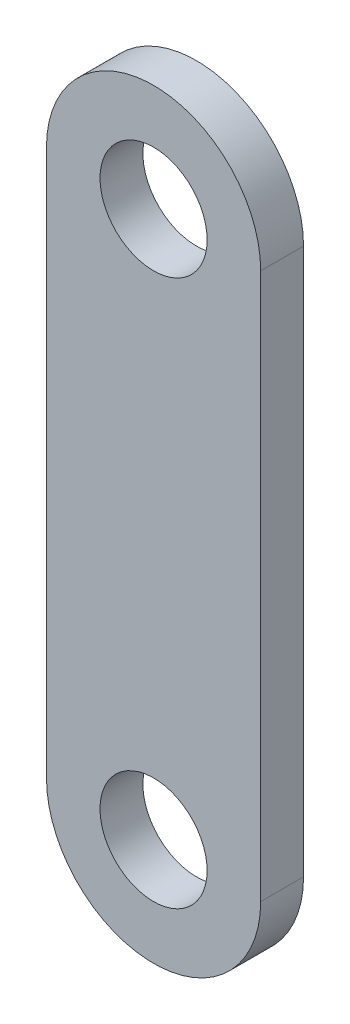
ISO-10303-21;
HEADER;
FILE_DESCRIPTION(('STEP AP214'),'2;1');
FILE_NAME('part.step','',(''),(''),'','','');
FILE_SCHEMA(('AUTOMOTIVE_DESIGN { 1 0 10303 214 1 1 1 1 }'));
ENDSEC;
DATA;
#1=APPLICATION_CONTEXT('core data for automotive mechanical design processes');
#2=APPLICATION_PROTOCOL_DEFINITION('international standard','automotive_design',2000,#1);
#3=PRODUCT_CONTEXT('',#1,'mechanical');
#4=PRODUCT('Part','Part','',(#3));
#5=PRODUCT_RELATED_PRODUCT_CATEGORY('part','',(#4));
#6=PRODUCT_DEFINITION_FORMATION('','',#4);
#7=PRODUCT_DEFINITION_CONTEXT('part definition',#1,'design');
#8=PRODUCT_DEFINITION('design','',#6,#7);
#9=PRODUCT_DEFINITION_SHAPE('','',#8);
#10=(LENGTH_UNIT() NAMED_UNIT(*) SI_UNIT(.MILLI.,.METRE.));
#11=(NAMED_UNIT(*) PLANE_ANGLE_UNIT() SI_UNIT($,.RADIAN.));
#12=(NAMED_UNIT(*) SI_UNIT($,.STERADIAN.) SOLID_ANGLE_UNIT());
#13=UNCERTAINTY_MEASURE_WITH_UNIT(LENGTH_MEASURE(1.E-05),#10,'distance_accuracy_value','');
#14=(GEOMETRIC_REPRESENTATION_CONTEXT(3) GLOBAL_UNCERTAINTY_ASSIGNED_CONTEXT((#13)) GLOBAL_UNIT_ASSIGNED_CONTEXT((#10,
#11,#12)) REPRESENTATION_CONTEXT('',''));
#15=CARTESIAN_POINT('',(0.,0.,0.));
#16=DIRECTION('',(0.,0.,1.));
#17=DIRECTION('',(1.,0.,0.));
#18=AXIS2_PLACEMENT_3D('',#15,#16,#17);
#19=CARTESIAN_POINT('',(0.,127.5,10.));
#20=DIRECTION('',(0.,0.,1.));
#21=DIRECTION('',(1.,0.,0.));
#22=AXIS2_PLACEMENT_3D('',#19,#20,#21);
#23=PLANE('',#22);
#24=CARTESIAN_POINT('',(0.,127.5,10.));
#25=DIRECTION('',(0.,0.,1.));
#26=DIRECTION('',(1.,0.,0.));
#27=AXIS2_PLACEMENT_3D('',#24,#25,#26);
#28=CIRCLE('',#27,25.);
#29=CARTESIAN_POINT('',(24.9999999999999,127.5,10.));
#30=VERTEX_POINT('',#29);
#31=EDGE_CURVE('E100',#30,#30,#28,.T.);
#32=ORIENTED_EDGE('',*,*,#31,.F.);
#33=EDGE_LOOP('',(#32));
#34=FACE_BOUND('',#33,.T.);
#35=CARTESIAN_POINT('',(0.,127.5,10.));
#36=DIRECTION('',(0.,0.,1.));
#37=DIRECTION('',(1.,0.,0.));
#38=AXIS2_PLACEMENT_3D('',#35,#36,#37);
#39=CIRCLE('',#38,50.);
#40=CARTESIAN_POINT('',(50.,127.5,10.));
#41=VERTEX_POINT('',#40);
#42=CARTESIAN_POINT('',(-50.0000000000001,127.5,10.));
#43=VERTEX_POINT('',#42);
#44=EDGE_CURVE('E85',#41,#43,#39,.T.);
#45=ORIENTED_EDGE('',*,*,#44,.T.);
#46=DIRECTION('',(0.,-1.,0.));
#47=VECTOR('',#46,1.);
#48=CARTESIAN_POINT('',(-50.0000000000001,127.5,10.));
#49=LINE('',#48,#47);
#50=CARTESIAN_POINT('',(-50.0000000000001,-127.5,10.));
#51=VERTEX_POINT('',#50);
#52=EDGE_CURVE('E80',#43,#51,#49,.T.);
#53=ORIENTED_EDGE('',*,*,#52,.T.);
#54=CARTESIAN_POINT('',(0.,-127.5,10.));
#55=DIRECTION('',(0.,0.,1.));
#56=DIRECTION('',(1.,0.,0.));
#57=AXIS2_PLACEMENT_3D('',#54,#55,#56);
#58=CIRCLE('',#57,50.);
#59=CARTESIAN_POINT('',(50.,-127.5,10.));
#60=VERTEX_POINT('',#59);
#61=EDGE_CURVE('E83',#51,#60,#58,.T.);
#62=ORIENTED_EDGE('',*,*,#61,.T.);
#63=DIRECTION('',(0.,1.,0.));
#64=VECTOR('',#63,1.);
#65=CARTESIAN_POINT('',(50.,127.5,10.));
#66=LINE('',#65,#64);
#67=EDGE_CURVE('E50',#60,#41,#66,.T.);
#68=ORIENTED_EDGE('',*,*,#67,.T.);
#69=EDGE_LOOP('',(#45,#53,#62,#68));
#70=FACE_BOUND('',#69,.T.);
#71=CARTESIAN_POINT('',(0.,-127.5,10.));
#72=DIRECTION('',(0.,0.,1.));
#73=DIRECTION('',(1.,0.,0.));
#74=AXIS2_PLACEMENT_3D('',#71,#72,#73);
#75=CIRCLE('',#74,25.);
#76=CARTESIAN_POINT('',(25.,-127.5,10.));
#77=VERTEX_POINT('',#76);
#78=EDGE_CURVE('E115',#77,#77,#75,.T.);
#79=ORIENTED_EDGE('',*,*,#78,.F.);
#80=EDGE_LOOP('',(#79));
#81=FACE_BOUND('',#80,.T.);
#82=ADVANCED_FACE('F33',(#34,#70,#81),#23,.T.);
#83=CARTESIAN_POINT('',(0.,127.5,-10.));
#84=DIRECTION('',(0.,0.,1.));
#85=DIRECTION('',(1.,0.,0.));
#86=AXIS2_PLACEMENT_3D('',#83,#84,#85);
#87=PLANE('',#86);
#88=CARTESIAN_POINT('',(0.,127.5,-10.));
#89=DIRECTION('',(0.,0.,1.));
#90=DIRECTION('',(1.,0.,0.));
#91=AXIS2_PLACEMENT_3D('',#88,#89,#90);
#92=CIRCLE('',#91,50.);
#93=CARTESIAN_POINT('',(50.,127.5,-10.));
#94=VERTEX_POINT('',#93);
#95=CARTESIAN_POINT('',(-50.0000000000001,127.5,-10.));
#96=VERTEX_POINT('',#95);
#97=EDGE_CURVE('E97',#94,#96,#92,.T.);
#98=ORIENTED_EDGE('',*,*,#97,.F.);
#99=DIRECTION('',(0.,1.,0.));
#100=VECTOR('',#99,1.);
#101=CARTESIAN_POINT('',(50.,127.5,-10.));
#102=LINE('',#101,#100);
#103=CARTESIAN_POINT('',(50.,-127.5,-10.));
#104=VERTEX_POINT('',#103);
#105=EDGE_CURVE('E73',#104,#94,#102,.T.);
#106=ORIENTED_EDGE('',*,*,#105,.F.);
#107=CARTESIAN_POINT('',(0.,-127.5,-10.));
#108=DIRECTION('',(0.,0.,1.));
#109=DIRECTION('',(1.,0.,0.));
#110=AXIS2_PLACEMENT_3D('',#107,#108,#109);
#111=CIRCLE('',#110,50.);
#112=CARTESIAN_POINT('',(-50.0000000000001,-127.5,-10.));
#113=VERTEX_POINT('',#112);
#114=EDGE_CURVE('E67',#113,#104,#111,.T.);
#115=ORIENTED_EDGE('',*,*,#114,.F.);
#116=DIRECTION('',(0.,-1.,0.));
#117=VECTOR('',#116,1.);
#118=CARTESIAN_POINT('',(-50.0000000000001,127.5,-10.));
#119=LINE('',#118,#117);
#120=EDGE_CURVE('E89',#96,#113,#119,.T.);
#121=ORIENTED_EDGE('',*,*,#120,.F.);
#122=EDGE_LOOP('',(#98,#106,#115,#121));
#123=FACE_BOUND('',#122,.T.);
#124=CARTESIAN_POINT('',(0.,127.5,-10.));
#125=DIRECTION('',(0.,0.,1.));
#126=DIRECTION('',(1.,0.,0.));
#127=AXIS2_PLACEMENT_3D('',#124,#125,#126);
#128=CIRCLE('',#127,25.);
#129=CARTESIAN_POINT('',(24.9999999999999,127.5,-10.));
#130=VERTEX_POINT('',#129);
#131=EDGE_CURVE('E112',#130,#130,#128,.T.);
#132=ORIENTED_EDGE('',*,*,#131,.T.);
#133=EDGE_LOOP('',(#132));
#134=FACE_BOUND('',#133,.T.);
#135=CARTESIAN_POINT('',(0.,-127.5,-10.));
#136=DIRECTION('',(0.,0.,1.));
#137=DIRECTION('',(1.,0.,0.));
#138=AXIS2_PLACEMENT_3D('',#135,#136,#137);
#139=CIRCLE('',#138,25.);
#140=CARTESIAN_POINT('',(25.,-127.5,-10.));
#141=VERTEX_POINT('',#140);
#142=EDGE_CURVE('E118',#141,#141,#139,.T.);
#143=ORIENTED_EDGE('',*,*,#142,.T.);
#144=EDGE_LOOP('',(#143));
#145=FACE_BOUND('',#144,.T.);
#146=ADVANCED_FACE('F108',(#123,#134,#145),#87,.F.);
#147=CARTESIAN_POINT('',(0.,127.5,10.));
#148=DIRECTION('',(0.,0.,-1.));
#149=DIRECTION('',(-1.,0.,0.));
#150=AXIS2_PLACEMENT_3D('',#147,#148,#149);
#151=CYLINDRICAL_SURFACE('',#150,50.);
#152=ORIENTED_EDGE('',*,*,#97,.T.);
#153=DIRECTION('',(0.,0.,-1.));
#154=VECTOR('',#153,1.);
#155=CARTESIAN_POINT('',(-50.0000000000001,127.5,10.));
#156=LINE('',#155,#154);
#157=EDGE_CURVE('E11',#43,#96,#156,.T.);
#158=ORIENTED_EDGE('',*,*,#157,.F.);
#159=ORIENTED_EDGE('',*,*,#44,.F.);
#160=DIRECTION('',(0.,0.,-1.));
#161=VECTOR('',#160,1.);
#162=CARTESIAN_POINT('',(50.,127.5,10.));
#163=LINE('',#162,#161);
#164=EDGE_CURVE('E93',#41,#94,#163,.T.);
#165=ORIENTED_EDGE('',*,*,#164,.T.);
#166=EDGE_LOOP('',(#152,#158,#159,#165));
#167=FACE_BOUND('',#166,.T.);
#168=ADVANCED_FACE('F35',(#167),#151,.T.);
#169=CARTESIAN_POINT('',(-50.0000000000001,127.5,10.));
#170=DIRECTION('',(1.,0.,0.));
#171=DIRECTION('',(0.,0.,-1.));
#172=AXIS2_PLACEMENT_3D('',#169,#170,#171);
#173=PLANE('',#172);
#174=ORIENTED_EDGE('',*,*,#120,.T.);
#175=DIRECTION('',(0.,0.,-1.));
#176=VECTOR('',#175,1.);
#177=CARTESIAN_POINT('',(-50.0000000000001,-127.5,10.));
#178=LINE('',#177,#176);
#179=EDGE_CURVE('E42',#51,#113,#178,.T.);
#180=ORIENTED_EDGE('',*,*,#179,.F.);
#181=ORIENTED_EDGE('',*,*,#52,.F.);
#182=ORIENTED_EDGE('',*,*,#157,.T.);
#183=EDGE_LOOP('',(#174,#180,#181,#182));
#184=FACE_BOUND('',#183,.T.);
#185=ADVANCED_FACE('F88',(#184),#173,.F.);
#186=CARTESIAN_POINT('',(0.,-127.5,10.));
#187=DIRECTION('',(0.,0.,-1.));
#188=DIRECTION('',(-1.,0.,0.));
#189=AXIS2_PLACEMENT_3D('',#186,#187,#188);
#190=CYLINDRICAL_SURFACE('',#189,50.);
#191=ORIENTED_EDGE('',*,*,#114,.T.);
#192=DIRECTION('',(0.,0.,-1.));
#193=VECTOR('',#192,1.);
#194=CARTESIAN_POINT('',(50.,-127.5,10.));
#195=LINE('',#194,#193);
#196=EDGE_CURVE('E90',#60,#104,#195,.T.);
#197=ORIENTED_EDGE('',*,*,#196,.F.);
#198=ORIENTED_EDGE('',*,*,#61,.F.);
#199=ORIENTED_EDGE('',*,*,#179,.T.);
#200=EDGE_LOOP('',(#191,#197,#198,#199));
#201=FACE_BOUND('',#200,.T.);
#202=ADVANCED_FACE('F91',(#201),#190,.T.);
#203=CARTESIAN_POINT('',(50.,127.5,10.));
#204=DIRECTION('',(-1.,0.,0.));
#205=DIRECTION('',(0.,0.,1.));
#206=AXIS2_PLACEMENT_3D('',#203,#204,#205);
#207=PLANE('',#206);
#208=ORIENTED_EDGE('',*,*,#105,.T.);
#209=ORIENTED_EDGE('',*,*,#164,.F.);
#210=ORIENTED_EDGE('',*,*,#67,.F.);
#211=ORIENTED_EDGE('',*,*,#196,.T.);
#212=EDGE_LOOP('',(#208,#209,#210,#211));
#213=FACE_BOUND('',#212,.T.);
#214=ADVANCED_FACE('F105',(#213),#207,.F.);
#215=CARTESIAN_POINT('',(0.,127.5,10.));
#216=DIRECTION('',(0.,0.,-1.));
#217=DIRECTION('',(-1.,0.,0.));
#218=AXIS2_PLACEMENT_3D('',#215,#216,#217);
#219=CYLINDRICAL_SURFACE('',#218,25.);
#220=ORIENTED_EDGE('',*,*,#31,.T.);
#221=EDGE_LOOP('',(#220));
#222=FACE_BOUND('',#221,.T.);
#223=ORIENTED_EDGE('',*,*,#131,.F.);
#224=EDGE_LOOP('',(#223));
#225=FACE_BOUND('',#224,.T.);
#226=ADVANCED_FACE('F135',(#222,#225),#219,.F.);
#227=CARTESIAN_POINT('',(0.,-127.5,10.));
#228=DIRECTION('',(0.,0.,-1.));
#229=DIRECTION('',(-1.,0.,0.));
#230=AXIS2_PLACEMENT_3D('',#227,#228,#229);
#231=CYLINDRICAL_SURFACE('',#230,25.);
#232=ORIENTED_EDGE('',*,*,#78,.T.);
#233=EDGE_LOOP('',(#232));
#234=FACE_BOUND('',#233,.T.);
#235=ORIENTED_EDGE('',*,*,#142,.F.);
#236=EDGE_LOOP('',(#235));
#237=FACE_BOUND('',#236,.T.);
#238=ADVANCED_FACE('F124',(#234,#237),#231,.F.);
#239=CLOSED_SHELL('',(#82,#146,#168,#185,#202,#214,#226,#238));
#240=MANIFOLD_SOLID_BREP('B2',#239);
#241=ADVANCED_BREP_SHAPE_REPRESENTATION('',(#18,#240),#14);
#242=SHAPE_DEFINITION_REPRESENTATION(#9,#241);
ENDSEC;
END-ISO-10303-21;
